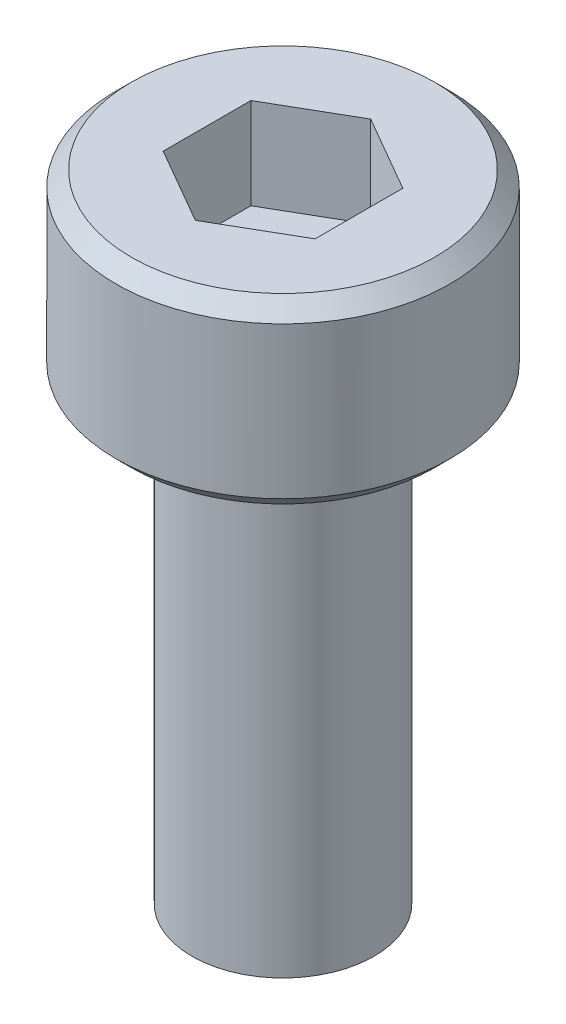
ISO-10303-21;
HEADER;
FILE_DESCRIPTION(('STEP AP214'),'2;1');
FILE_NAME('part.step','',(''),(''),'','','');
FILE_SCHEMA(('AUTOMOTIVE_DESIGN { 1 0 10303 214 1 1 1 1 }'));
ENDSEC;
DATA;
#1=APPLICATION_CONTEXT('core data for automotive mechanical design processes');
#2=APPLICATION_PROTOCOL_DEFINITION('international standard','automotive_design',2000,#1);
#3=PRODUCT_CONTEXT('',#1,'mechanical');
#4=PRODUCT('Part','Part','',(#3));
#5=PRODUCT_RELATED_PRODUCT_CATEGORY('part','',(#4));
#6=PRODUCT_DEFINITION_FORMATION('','',#4);
#7=PRODUCT_DEFINITION_CONTEXT('part definition',#1,'design');
#8=PRODUCT_DEFINITION('design','',#6,#7);
#9=PRODUCT_DEFINITION_SHAPE('','',#8);
#10=(LENGTH_UNIT() NAMED_UNIT(*) SI_UNIT(.MILLI.,.METRE.));
#11=(NAMED_UNIT(*) PLANE_ANGLE_UNIT() SI_UNIT($,.RADIAN.));
#12=(NAMED_UNIT(*) SI_UNIT($,.STERADIAN.) SOLID_ANGLE_UNIT());
#13=UNCERTAINTY_MEASURE_WITH_UNIT(LENGTH_MEASURE(1.E-05),#10,'distance_accuracy_value','');
#14=(GEOMETRIC_REPRESENTATION_CONTEXT(3) GLOBAL_UNCERTAINTY_ASSIGNED_CONTEXT((#13)) GLOBAL_UNIT_ASSIGNED_CONTEXT((#10,
#11,#12)) REPRESENTATION_CONTEXT('',''));
#15=CARTESIAN_POINT('',(0.,0.,0.));
#16=DIRECTION('',(0.,0.,1.));
#17=DIRECTION('',(1.,0.,0.));
#18=AXIS2_PLACEMENT_3D('',#15,#16,#17);
#19=CARTESIAN_POINT('',(-1.25,1.5,0.721687836487032));
#20=DIRECTION('',(0.,-1.,0.));
#21=DIRECTION('',(0.,0.,-1.));
#22=AXIS2_PLACEMENT_3D('',#19,#20,#21);
#23=PLANE('',#22);
#24=DIRECTION('',(0.866025403784439,0.,-0.5));
#25=VECTOR('',#24,1.);
#26=CARTESIAN_POINT('',(0.,1.5,1.44337567297406));
#27=LINE('',#26,#25);
#28=CARTESIAN_POINT('',(0.,1.5,1.44337567297406));
#29=VERTEX_POINT('',#28);
#30=CARTESIAN_POINT('',(1.25,1.5,0.721687836487032));
#31=VERTEX_POINT('',#30);
#32=EDGE_CURVE('E127',#29,#31,#27,.T.);
#33=ORIENTED_EDGE('',*,*,#32,.T.);
#34=DIRECTION('',(0.,0.,-1.));
#35=VECTOR('',#34,1.);
#36=CARTESIAN_POINT('',(1.25,1.5,0.721687836487032));
#37=LINE('',#36,#35);
#38=CARTESIAN_POINT('',(1.25,1.5,-0.721687836487032));
#39=VERTEX_POINT('',#38);
#40=EDGE_CURVE('E132',#31,#39,#37,.T.);
#41=ORIENTED_EDGE('',*,*,#40,.T.);
#42=DIRECTION('',(-0.866025403784439,0.,-0.5));
#43=VECTOR('',#42,1.);
#44=CARTESIAN_POINT('',(1.25,1.5,-0.721687836487032));
#45=LINE('',#44,#43);
#46=CARTESIAN_POINT('',(0.,1.5,-1.44337567297406));
#47=VERTEX_POINT('',#46);
#48=EDGE_CURVE('E136',#39,#47,#45,.T.);
#49=ORIENTED_EDGE('',*,*,#48,.T.);
#50=DIRECTION('',(-0.866025403784439,0.,0.5));
#51=VECTOR('',#50,1.);
#52=CARTESIAN_POINT('',(0.,1.5,-1.44337567297406));
#53=LINE('',#52,#51);
#54=CARTESIAN_POINT('',(-1.25,1.5,-0.721687836487032));
#55=VERTEX_POINT('',#54);
#56=EDGE_CURVE('E68',#47,#55,#53,.T.);
#57=ORIENTED_EDGE('',*,*,#56,.T.);
#58=DIRECTION('',(0.,0.,1.));
#59=VECTOR('',#58,1.);
#60=CARTESIAN_POINT('',(-1.25,1.5,-0.721687836487032));
#61=LINE('',#60,#59);
#62=CARTESIAN_POINT('',(-1.25,1.5,0.721687836487033));
#63=VERTEX_POINT('',#62);
#64=EDGE_CURVE('E70',#55,#63,#61,.T.);
#65=ORIENTED_EDGE('',*,*,#64,.T.);
#66=DIRECTION('',(0.866025403784439,0.,0.5));
#67=VECTOR('',#66,1.);
#68=CARTESIAN_POINT('',(-1.25,1.5,0.721687836487032));
#69=LINE('',#68,#67);
#70=EDGE_CURVE('E72',#63,#29,#69,.T.);
#71=ORIENTED_EDGE('',*,*,#70,.T.);
#72=EDGE_LOOP('',(#33,#41,#49,#57,#65,#71));
#73=FACE_BOUND('',#72,.T.);
#74=ADVANCED_FACE('F17',(#73),#23,.F.);
#75=CARTESIAN_POINT('',(-1.25,1.5,0.721687836487032));
#76=DIRECTION('',(-0.5,0.,0.866025403784439));
#77=DIRECTION('',(0.866025403784439,0.,0.5));
#78=AXIS2_PLACEMENT_3D('',#75,#76,#77);
#79=PLANE('',#78);
#80=DIRECTION('',(0.,1.,0.));
#81=VECTOR('',#80,1.);
#82=CARTESIAN_POINT('',(0.,1.5,1.44337567297406));
#83=LINE('',#82,#81);
#84=CARTESIAN_POINT('',(0.,3.,1.44337567297406));
#85=VERTEX_POINT('',#84);
#86=EDGE_CURVE('E83',#85,#29,#83,.F.);
#87=ORIENTED_EDGE('',*,*,#86,.T.);
#88=ORIENTED_EDGE('',*,*,#70,.F.);
#89=DIRECTION('',(0.,1.,0.));
#90=VECTOR('',#89,1.);
#91=CARTESIAN_POINT('',(-1.25,1.5,0.721687836487032));
#92=LINE('',#91,#90);
#93=CARTESIAN_POINT('',(-1.25,3.,0.721687836487032));
#94=VERTEX_POINT('',#93);
#95=EDGE_CURVE('E77',#63,#94,#92,.T.);
#96=ORIENTED_EDGE('',*,*,#95,.T.);
#97=DIRECTION('',(-0.866025403784439,0.,-0.5));
#98=VECTOR('',#97,1.);
#99=CARTESIAN_POINT('',(0.,3.,1.44337567297406));
#100=LINE('',#99,#98);
#101=EDGE_CURVE('E124',#85,#94,#100,.T.);
#102=ORIENTED_EDGE('',*,*,#101,.F.);
#103=EDGE_LOOP('',(#87,#88,#96,#102));
#104=FACE_BOUND('',#103,.T.);
#105=ADVANCED_FACE('F80',(#104),#79,.F.);
#106=CARTESIAN_POINT('',(-1.25,1.5,-0.721687836487032));
#107=DIRECTION('',(-1.,0.,0.));
#108=DIRECTION('',(0.,0.,1.));
#109=AXIS2_PLACEMENT_3D('',#106,#107,#108);
#110=PLANE('',#109);
#111=ORIENTED_EDGE('',*,*,#95,.F.);
#112=ORIENTED_EDGE('',*,*,#64,.F.);
#113=DIRECTION('',(0.,1.,0.));
#114=VECTOR('',#113,1.);
#115=CARTESIAN_POINT('',(-1.25,1.5,-0.721687836487032));
#116=LINE('',#115,#114);
#117=CARTESIAN_POINT('',(-1.25,3.,-0.721687836487032));
#118=VERTEX_POINT('',#117);
#119=EDGE_CURVE('E91',#55,#118,#116,.T.);
#120=ORIENTED_EDGE('',*,*,#119,.T.);
#121=DIRECTION('',(0.,0.,1.));
#122=VECTOR('',#121,1.);
#123=CARTESIAN_POINT('',(-1.25,3.,0.));
#124=LINE('',#123,#122);
#125=EDGE_CURVE('E88',#94,#118,#124,.F.);
#126=ORIENTED_EDGE('',*,*,#125,.F.);
#127=EDGE_LOOP('',(#111,#112,#120,#126));
#128=FACE_BOUND('',#127,.T.);
#129=ADVANCED_FACE('F86',(#128),#110,.F.);
#130=CARTESIAN_POINT('',(0.,1.5,-1.44337567297406));
#131=DIRECTION('',(-0.5,0.,-0.866025403784439));
#132=DIRECTION('',(-0.866025403784439,0.,0.5));
#133=AXIS2_PLACEMENT_3D('',#130,#131,#132);
#134=PLANE('',#133);
#135=ORIENTED_EDGE('',*,*,#119,.F.);
#136=ORIENTED_EDGE('',*,*,#56,.F.);
#137=DIRECTION('',(0.,1.,0.));
#138=VECTOR('',#137,1.);
#139=CARTESIAN_POINT('',(0.,1.5,-1.44337567297406));
#140=LINE('',#139,#138);
#141=CARTESIAN_POINT('',(0.,3.,-1.44337567297406));
#142=VERTEX_POINT('',#141);
#143=EDGE_CURVE('E134',#47,#142,#140,.T.);
#144=ORIENTED_EDGE('',*,*,#143,.T.);
#145=DIRECTION('',(0.866025403784439,0.,-0.5));
#146=VECTOR('',#145,1.);
#147=CARTESIAN_POINT('',(-1.25,3.,-0.721687836487032));
#148=LINE('',#147,#146);
#149=EDGE_CURVE('E120',#118,#142,#148,.T.);
#150=ORIENTED_EDGE('',*,*,#149,.F.);
#151=EDGE_LOOP('',(#135,#136,#144,#150));
#152=FACE_BOUND('',#151,.T.);
#153=ADVANCED_FACE('F139',(#152),#134,.F.);
#154=CARTESIAN_POINT('',(1.25,1.5,-0.721687836487032));
#155=DIRECTION('',(0.5,0.,-0.866025403784439));
#156=DIRECTION('',(-0.866025403784439,0.,-0.5));
#157=AXIS2_PLACEMENT_3D('',#154,#155,#156);
#158=PLANE('',#157);
#159=ORIENTED_EDGE('',*,*,#143,.F.);
#160=ORIENTED_EDGE('',*,*,#48,.F.);
#161=DIRECTION('',(0.,1.,0.));
#162=VECTOR('',#161,1.);
#163=CARTESIAN_POINT('',(1.25,1.5,-0.721687836487032));
#164=LINE('',#163,#162);
#165=CARTESIAN_POINT('',(1.25,3.,-0.721687836487032));
#166=VERTEX_POINT('',#165);
#167=EDGE_CURVE('E130',#39,#166,#164,.T.);
#168=ORIENTED_EDGE('',*,*,#167,.T.);
#169=DIRECTION('',(0.866025403784438,0.,0.5));
#170=VECTOR('',#169,1.);
#171=CARTESIAN_POINT('',(0.,3.,-1.44337567297406));
#172=LINE('',#171,#170);
#173=EDGE_CURVE('E117',#142,#166,#172,.T.);
#174=ORIENTED_EDGE('',*,*,#173,.F.);
#175=EDGE_LOOP('',(#159,#160,#168,#174));
#176=FACE_BOUND('',#175,.T.);
#177=ADVANCED_FACE('F151',(#176),#158,.F.);
#178=CARTESIAN_POINT('',(1.25,1.5,0.721687836487032));
#179=DIRECTION('',(1.,0.,0.));
#180=DIRECTION('',(0.,0.,-1.));
#181=AXIS2_PLACEMENT_3D('',#178,#179,#180);
#182=PLANE('',#181);
#183=ORIENTED_EDGE('',*,*,#167,.F.);
#184=ORIENTED_EDGE('',*,*,#40,.F.);
#185=DIRECTION('',(0.,1.,0.));
#186=VECTOR('',#185,1.);
#187=CARTESIAN_POINT('',(1.25,1.5,0.721687836487032));
#188=LINE('',#187,#186);
#189=CARTESIAN_POINT('',(1.25,3.,0.721687836487032));
#190=VERTEX_POINT('',#189);
#191=EDGE_CURVE('E35',#31,#190,#188,.T.);
#192=ORIENTED_EDGE('',*,*,#191,.T.);
#193=DIRECTION('',(0.,0.,1.));
#194=VECTOR('',#193,1.);
#195=CARTESIAN_POINT('',(1.25,3.,0.));
#196=LINE('',#195,#194);
#197=EDGE_CURVE('E114',#166,#190,#196,.T.);
#198=ORIENTED_EDGE('',*,*,#197,.F.);
#199=EDGE_LOOP('',(#183,#184,#192,#198));
#200=FACE_BOUND('',#199,.T.);
#201=ADVANCED_FACE('F149',(#200),#182,.F.);
#202=CARTESIAN_POINT('',(0.,1.5,1.44337567297406));
#203=DIRECTION('',(0.5,0.,0.866025403784439));
#204=DIRECTION('',(0.866025403784439,0.,-0.5));
#205=AXIS2_PLACEMENT_3D('',#202,#203,#204);
#206=PLANE('',#205);
#207=ORIENTED_EDGE('',*,*,#191,.F.);
#208=ORIENTED_EDGE('',*,*,#32,.F.);
#209=ORIENTED_EDGE('',*,*,#86,.F.);
#210=DIRECTION('',(-0.866025403784439,0.,0.5));
#211=VECTOR('',#210,1.);
#212=CARTESIAN_POINT('',(1.25,3.,0.721687836487032));
#213=LINE('',#212,#211);
#214=EDGE_CURVE('E111',#190,#85,#213,.T.);
#215=ORIENTED_EDGE('',*,*,#214,.F.);
#216=EDGE_LOOP('',(#207,#208,#209,#215));
#217=FACE_BOUND('',#216,.T.);
#218=ADVANCED_FACE('F146',(#217),#206,.F.);
#219=CARTESIAN_POINT('',(0.,3.,0.));
#220=DIRECTION('',(0.,1.,0.));
#221=DIRECTION('',(0.,0.,1.));
#222=AXIS2_PLACEMENT_3D('',#219,#220,#221);
#223=PLANE('',#222);
#224=ORIENTED_EDGE('',*,*,#197,.T.);
#225=ORIENTED_EDGE('',*,*,#214,.T.);
#226=ORIENTED_EDGE('',*,*,#101,.T.);
#227=ORIENTED_EDGE('',*,*,#125,.T.);
#228=ORIENTED_EDGE('',*,*,#149,.T.);
#229=ORIENTED_EDGE('',*,*,#173,.T.);
#230=EDGE_LOOP('',(#224,#225,#226,#227,#228,#229));
#231=FACE_BOUND('',#230,.T.);
#232=CARTESIAN_POINT('',(0.,3.00000000004275,0.));
#233=DIRECTION('',(0.,-1.,0.));
#234=DIRECTION('',(0.,0.,-1.));
#235=AXIS2_PLACEMENT_3D('',#232,#233,#234);
#236=CIRCLE('',#235,2.49600000000783);
#237=CARTESIAN_POINT('',(0.,3.00000000004275,-2.49600000000783));
#238=VERTEX_POINT('',#237);
#239=EDGE_CURVE('E20',#238,#238,#236,.T.);
#240=ORIENTED_EDGE('',*,*,#239,.F.);
#241=EDGE_LOOP('',(#240));
#242=FACE_BOUND('',#241,.T.);
#243=ADVANCED_FACE('F143',(#231,#242),#223,.T.);
#244=CARTESIAN_POINT('',(0.,2.7460000001156,0.));
#245=DIRECTION('',(0.,-1.,0.));
#246=DIRECTION('',(0.,0.,-1.));
#247=AXIS2_PLACEMENT_3D('',#244,#245,#246);
#248=CONICAL_SURFACE('',#247,2.74999999993497,0.785398163397448);
#249=ORIENTED_EDGE('',*,*,#239,.T.);
#250=EDGE_LOOP('',(#249));
#251=FACE_BOUND('',#250,.T.);
#252=CARTESIAN_POINT('',(0.,2.746,0.));
#253=DIRECTION('',(0.,-1.,0.));
#254=DIRECTION('',(0.,0.,-1.));
#255=AXIS2_PLACEMENT_3D('',#252,#253,#254);
#256=CIRCLE('',#255,2.75);
#257=CARTESIAN_POINT('',(0.,2.746,-2.75));
#258=VERTEX_POINT('',#257);
#259=EDGE_CURVE('E103',#258,#258,#256,.T.);
#260=ORIENTED_EDGE('',*,*,#259,.F.);
#261=EDGE_LOOP('',(#260));
#262=FACE_BOUND('',#261,.T.);
#263=ADVANCED_FACE('F188',(#251,#262),#248,.T.);
#264=CARTESIAN_POINT('',(0.,3.,0.));
#265=DIRECTION('',(0.,-1.,0.));
#266=DIRECTION('',(0.,0.,-1.));
#267=AXIS2_PLACEMENT_3D('',#264,#265,#266);
#268=CYLINDRICAL_SURFACE('',#267,2.75);
#269=ORIENTED_EDGE('',*,*,#259,.T.);
#270=EDGE_LOOP('',(#269));
#271=FACE_BOUND('',#270,.T.);
#272=CARTESIAN_POINT('',(0.,0.253999999983989,0.));
#273=DIRECTION('',(0.,1.,0.));
#274=DIRECTION('',(0.,0.,1.));
#275=AXIS2_PLACEMENT_3D('',#272,#273,#274);
#276=CIRCLE('',#275,2.74999999999181);
#277=CARTESIAN_POINT('',(0.,0.253999999983989,2.74999999999181));
#278=VERTEX_POINT('',#277);
#279=EDGE_CURVE('E99',#278,#278,#276,.F.);
#280=ORIENTED_EDGE('',*,*,#279,.F.);
#281=EDGE_LOOP('',(#280));
#282=FACE_BOUND('',#281,.T.);
#283=ADVANCED_FACE('F184',(#271,#282),#268,.T.);
#284=CARTESIAN_POINT('',(0.,-8.,0.));
#285=DIRECTION('',(0.,1.,0.));
#286=DIRECTION('',(0.,0.,1.));
#287=AXIS2_PLACEMENT_3D('',#284,#285,#286);
#288=PLANE('',#287);
#289=CARTESIAN_POINT('',(0.,-7.99999999998136,0.));
#290=DIRECTION('',(0.,1.,0.));
#291=DIRECTION('',(0.,0.,1.));
#292=AXIS2_PLACEMENT_3D('',#289,#290,#291);
#293=CIRCLE('',#292,0.730379999993147);
#294=CARTESIAN_POINT('',(0.,-7.99999999998136,0.730379999993147));
#295=VERTEX_POINT('',#294);
#296=EDGE_CURVE('E97',#295,#295,#293,.T.);
#297=ORIENTED_EDGE('',*,*,#296,.F.);
#298=EDGE_LOOP('',(#297));
#299=FACE_BOUND('',#298,.T.);
#300=ADVANCED_FACE('F180',(#299),#288,.F.);
#301=CARTESIAN_POINT('',(0.,0.254000000040833,0.));
#302=DIRECTION('',(0.,1.,0.));
#303=DIRECTION('',(0.,0.,1.));
#304=AXIS2_PLACEMENT_3D('',#301,#302,#303);
#305=CONICAL_SURFACE('',#304,2.7500000001055,0.785398163397448);
#306=CARTESIAN_POINT('',(0.,0.,0.));
#307=DIRECTION('',(0.,1.,0.));
#308=DIRECTION('',(0.,0.,1.));
#309=AXIS2_PLACEMENT_3D('',#306,#307,#308);
#310=CIRCLE('',#309,2.49600000006467);
#311=CARTESIAN_POINT('',(0.,0.,2.49600000006467));
#312=VERTEX_POINT('',#311);
#313=EDGE_CURVE('E95',#312,#312,#310,.T.);
#314=ORIENTED_EDGE('',*,*,#313,.T.);
#315=EDGE_LOOP('',(#314));
#316=FACE_BOUND('',#315,.T.);
#317=ORIENTED_EDGE('',*,*,#279,.T.);
#318=EDGE_LOOP('',(#317));
#319=FACE_BOUND('',#318,.T.);
#320=ADVANCED_FACE('F176',(#316,#319),#305,.T.);
#321=CARTESIAN_POINT('',(0.,-7.46151999999256,0.));
#322=DIRECTION('',(0.,1.,0.));
#323=DIRECTION('',(0.,0.,1.));
#324=AXIS2_PLACEMENT_3D('',#321,#322,#323);
#325=CONICAL_SURFACE('',#324,1.49999999996453,0.960291895402791);
#326=CARTESIAN_POINT('',(0.,-7.46152,0.));
#327=DIRECTION('',(0.,1.,0.));
#328=DIRECTION('',(0.,0.,1.));
#329=AXIS2_PLACEMENT_3D('',#326,#327,#328);
#330=CIRCLE('',#329,1.5);
#331=CARTESIAN_POINT('',(0.,-7.46152,1.5));
#332=VERTEX_POINT('',#331);
#333=EDGE_CURVE('E26',#332,#332,#330,.T.);
#334=ORIENTED_EDGE('',*,*,#333,.F.);
#335=EDGE_LOOP('',(#334));
#336=FACE_BOUND('',#335,.T.);
#337=ORIENTED_EDGE('',*,*,#296,.T.);
#338=EDGE_LOOP('',(#337));
#339=FACE_BOUND('',#338,.T.);
#340=ADVANCED_FACE('F169',(#336,#339),#325,.T.);
#341=CARTESIAN_POINT('',(0.,0.,0.));
#342=DIRECTION('',(0.,1.,0.));
#343=DIRECTION('',(0.,0.,1.));
#344=AXIS2_PLACEMENT_3D('',#341,#342,#343);
#345=PLANE('',#344);
#346=CARTESIAN_POINT('',(0.,0.,0.));
#347=DIRECTION('',(0.,1.,0.));
#348=DIRECTION('',(0.,0.,1.));
#349=AXIS2_PLACEMENT_3D('',#346,#347,#348);
#350=CIRCLE('',#349,1.5);
#351=CARTESIAN_POINT('',(0.,0.,1.5));
#352=VERTEX_POINT('',#351);
#353=EDGE_CURVE('E11',#352,#352,#350,.F.);
#354=ORIENTED_EDGE('',*,*,#353,.F.);
#355=EDGE_LOOP('',(#354));
#356=FACE_BOUND('',#355,.T.);
#357=ORIENTED_EDGE('',*,*,#313,.F.);
#358=EDGE_LOOP('',(#357));
#359=FACE_BOUND('',#358,.T.);
#360=ADVANCED_FACE('F163',(#356,#359),#345,.F.);
#361=CARTESIAN_POINT('',(0.,-8.,0.));
#362=DIRECTION('',(0.,1.,0.));
#363=DIRECTION('',(0.,0.,1.));
#364=AXIS2_PLACEMENT_3D('',#361,#362,#363);
#365=CYLINDRICAL_SURFACE('',#364,1.5);
#366=ORIENTED_EDGE('',*,*,#353,.T.);
#367=EDGE_LOOP('',(#366));
#368=FACE_BOUND('',#367,.T.);
#369=ORIENTED_EDGE('',*,*,#333,.T.);
#370=EDGE_LOOP('',(#369));
#371=FACE_BOUND('',#370,.T.);
#372=ADVANCED_FACE('F161',(#368,#371),#365,.T.);
#373=CLOSED_SHELL('',(#74,#105,#129,#153,#177,#201,#218,#243,#263,#283,#300,#320,#340,#360,#372));
#374=MANIFOLD_SOLID_BREP('B1',#373);
#375=ADVANCED_BREP_SHAPE_REPRESENTATION('',(#18,#374),#14);
#376=SHAPE_DEFINITION_REPRESENTATION(#9,#375);
ENDSEC;
END-ISO-10303-21;
